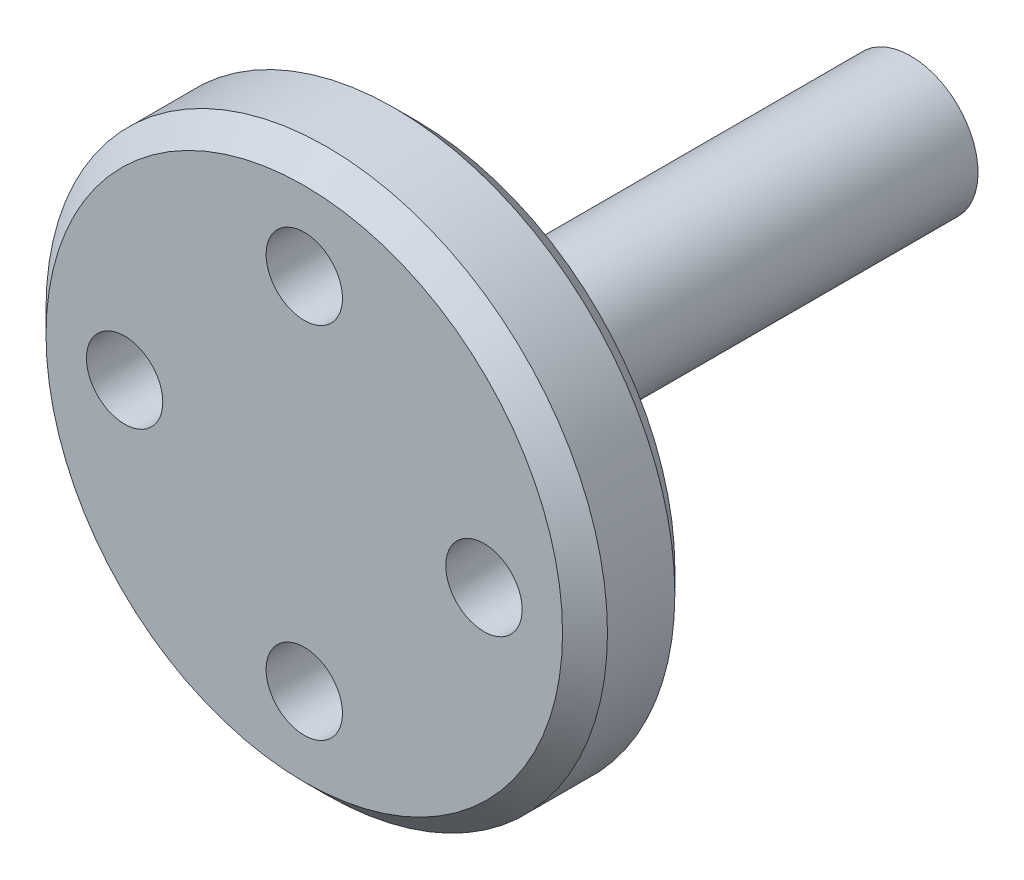
ISO-10303-21;
HEADER;
FILE_DESCRIPTION(('STEP AP214'),'2;1');
FILE_NAME('part.step','',(''),(''),'','','');
FILE_SCHEMA(('AUTOMOTIVE_DESIGN { 1 0 10303 214 1 1 1 1 }'));
ENDSEC;
DATA;
#1=APPLICATION_CONTEXT('core data for automotive mechanical design processes');
#2=APPLICATION_PROTOCOL_DEFINITION('international standard','automotive_design',2000,#1);
#3=PRODUCT_CONTEXT('',#1,'mechanical');
#4=PRODUCT('Part','Part','',(#3));
#5=PRODUCT_RELATED_PRODUCT_CATEGORY('part','',(#4));
#6=PRODUCT_DEFINITION_FORMATION('','',#4);
#7=PRODUCT_DEFINITION_CONTEXT('part definition',#1,'design');
#8=PRODUCT_DEFINITION('design','',#6,#7);
#9=PRODUCT_DEFINITION_SHAPE('','',#8);
#10=(LENGTH_UNIT() NAMED_UNIT(*) SI_UNIT(.MILLI.,.METRE.));
#11=(NAMED_UNIT(*) PLANE_ANGLE_UNIT() SI_UNIT($,.RADIAN.));
#12=(NAMED_UNIT(*) SI_UNIT($,.STERADIAN.) SOLID_ANGLE_UNIT());
#13=UNCERTAINTY_MEASURE_WITH_UNIT(LENGTH_MEASURE(1.E-05),#10,'distance_accuracy_value','');
#14=(GEOMETRIC_REPRESENTATION_CONTEXT(3) GLOBAL_UNCERTAINTY_ASSIGNED_CONTEXT((#13)) GLOBAL_UNIT_ASSIGNED_CONTEXT((#10,
#11,#12)) REPRESENTATION_CONTEXT('',''));
#15=CARTESIAN_POINT('',(0.,0.,0.));
#16=DIRECTION('',(0.,0.,1.));
#17=DIRECTION('',(1.,0.,0.));
#18=AXIS2_PLACEMENT_3D('',#15,#16,#17);
#19=CARTESIAN_POINT('',(0.,12.5,-5.));
#20=DIRECTION('',(0.,0.,-1.));
#21=DIRECTION('',(0.,1.,0.));
#22=AXIS2_PLACEMENT_3D('',#19,#20,#21);
#23=PLANE('',#22);
#24=CARTESIAN_POINT('',(0.,0.,-5.));
#25=DIRECTION('',(0.,0.,-1.));
#26=DIRECTION('',(0.,1.,0.));
#27=AXIS2_PLACEMENT_3D('',#24,#25,#26);
#28=CIRCLE('',#27,11.5);
#29=CARTESIAN_POINT('',(0.,11.5,-5.));
#30=VERTEX_POINT('',#29);
#31=EDGE_CURVE('E65',#30,#30,#28,.T.);
#32=ORIENTED_EDGE('',*,*,#31,.T.);
#33=EDGE_LOOP('',(#32));
#34=FACE_BOUND('',#33,.T.);
#35=CARTESIAN_POINT('',(-8.,0.,-5.));
#36=DIRECTION('',(0.,0.,-1.));
#37=DIRECTION('',(0.,1.,0.));
#38=AXIS2_PLACEMENT_3D('',#35,#36,#37);
#39=CIRCLE('',#38,1.69999999999999);
#40=CARTESIAN_POINT('',(-8.,1.7,-5.));
#41=VERTEX_POINT('',#40);
#42=EDGE_CURVE('E94',#41,#41,#39,.F.);
#43=ORIENTED_EDGE('',*,*,#42,.T.);
#44=EDGE_LOOP('',(#43));
#45=FACE_BOUND('',#44,.T.);
#46=CARTESIAN_POINT('',(8.,0.,-5.));
#47=DIRECTION('',(0.,0.,-1.));
#48=DIRECTION('',(0.,1.,0.));
#49=AXIS2_PLACEMENT_3D('',#46,#47,#48);
#50=CIRCLE('',#49,1.69999999999999);
#51=CARTESIAN_POINT('',(8.,1.7,-5.));
#52=VERTEX_POINT('',#51);
#53=EDGE_CURVE('E79',#52,#52,#50,.F.);
#54=ORIENTED_EDGE('',*,*,#53,.T.);
#55=EDGE_LOOP('',(#54));
#56=FACE_BOUND('',#55,.T.);
#57=CARTESIAN_POINT('',(0.,0.,-5.));
#58=DIRECTION('',(0.,0.,-1.));
#59=DIRECTION('',(0.,1.,0.));
#60=AXIS2_PLACEMENT_3D('',#57,#58,#59);
#61=CIRCLE('',#60,3.00000000000001);
#62=CARTESIAN_POINT('',(0.,3.00000000000001,-5.));
#63=VERTEX_POINT('',#62);
#64=EDGE_CURVE('E71',#63,#63,#61,.T.);
#65=ORIENTED_EDGE('',*,*,#64,.F.);
#66=EDGE_LOOP('',(#65));
#67=FACE_BOUND('',#66,.T.);
#68=CARTESIAN_POINT('',(0.,-8.,-5.00000000000001));
#69=DIRECTION('',(0.,0.,-1.));
#70=DIRECTION('',(0.,1.,0.));
#71=AXIS2_PLACEMENT_3D('',#68,#69,#70);
#72=CIRCLE('',#71,1.69999999999999);
#73=CARTESIAN_POINT('',(0.,-6.3,-5.));
#74=VERTEX_POINT('',#73);
#75=EDGE_CURVE('E86',#74,#74,#72,.F.);
#76=ORIENTED_EDGE('',*,*,#75,.T.);
#77=EDGE_LOOP('',(#76));
#78=FACE_BOUND('',#77,.T.);
#79=CARTESIAN_POINT('',(0.,8.,-5.));
#80=DIRECTION('',(0.,0.,-1.));
#81=DIRECTION('',(0.,1.,0.));
#82=AXIS2_PLACEMENT_3D('',#79,#80,#81);
#83=CIRCLE('',#82,1.69999999999999);
#84=CARTESIAN_POINT('',(0.,9.7,-5.));
#85=VERTEX_POINT('',#84);
#86=EDGE_CURVE('E100',#85,#85,#83,.F.);
#87=ORIENTED_EDGE('',*,*,#86,.T.);
#88=EDGE_LOOP('',(#87));
#89=FACE_BOUND('',#88,.T.);
#90=ADVANCED_FACE('F42',(#34,#45,#56,#67,#78,#89),#23,.T.);
#91=CARTESIAN_POINT('',(0.,0.,0.));
#92=DIRECTION('',(0.,0.,1.));
#93=DIRECTION('',(0.,-1.,0.));
#94=AXIS2_PLACEMENT_3D('',#91,#92,#93);
#95=PLANE('',#94);
#96=CARTESIAN_POINT('',(0.,0.,0.));
#97=DIRECTION('',(0.,0.,1.));
#98=DIRECTION('',(0.,-1.,0.));
#99=AXIS2_PLACEMENT_3D('',#96,#97,#98);
#100=CIRCLE('',#99,11.5);
#101=CARTESIAN_POINT('',(0.,-11.5,0.));
#102=VERTEX_POINT('',#101);
#103=EDGE_CURVE('E10',#102,#102,#100,.T.);
#104=ORIENTED_EDGE('',*,*,#103,.T.);
#105=EDGE_LOOP('',(#104));
#106=FACE_BOUND('',#105,.T.);
#107=CARTESIAN_POINT('',(0.,8.,0.));
#108=DIRECTION('',(0.,0.,1.));
#109=DIRECTION('',(0.,-1.,0.));
#110=AXIS2_PLACEMENT_3D('',#107,#108,#109);
#111=CIRCLE('',#110,1.69999999999999);
#112=CARTESIAN_POINT('',(0.,6.30000000000001,0.));
#113=VERTEX_POINT('',#112);
#114=EDGE_CURVE('E104',#113,#113,#111,.T.);
#115=ORIENTED_EDGE('',*,*,#114,.F.);
#116=EDGE_LOOP('',(#115));
#117=FACE_BOUND('',#116,.T.);
#118=CARTESIAN_POINT('',(-8.,0.,0.));
#119=DIRECTION('',(0.,0.,1.));
#120=DIRECTION('',(0.,-1.,0.));
#121=AXIS2_PLACEMENT_3D('',#118,#119,#120);
#122=CIRCLE('',#121,1.69999999999999);
#123=CARTESIAN_POINT('',(-8.,-1.69999999999999,0.));
#124=VERTEX_POINT('',#123);
#125=EDGE_CURVE('E97',#124,#124,#122,.T.);
#126=ORIENTED_EDGE('',*,*,#125,.F.);
#127=EDGE_LOOP('',(#126));
#128=FACE_BOUND('',#127,.T.);
#129=CARTESIAN_POINT('',(0.,-8.,0.));
#130=DIRECTION('',(0.,0.,1.));
#131=DIRECTION('',(0.,-1.,0.));
#132=AXIS2_PLACEMENT_3D('',#129,#130,#131);
#133=CIRCLE('',#132,1.69999999999999);
#134=CARTESIAN_POINT('',(0.,-9.69999999999999,0.));
#135=VERTEX_POINT('',#134);
#136=EDGE_CURVE('E90',#135,#135,#133,.T.);
#137=ORIENTED_EDGE('',*,*,#136,.F.);
#138=EDGE_LOOP('',(#137));
#139=FACE_BOUND('',#138,.T.);
#140=CARTESIAN_POINT('',(8.,0.,0.));
#141=DIRECTION('',(0.,0.,1.));
#142=DIRECTION('',(0.,-1.,0.));
#143=AXIS2_PLACEMENT_3D('',#140,#141,#142);
#144=CIRCLE('',#143,1.69999999999999);
#145=CARTESIAN_POINT('',(8.,-1.69999999999999,0.));
#146=VERTEX_POINT('',#145);
#147=EDGE_CURVE('E82',#146,#146,#144,.T.);
#148=ORIENTED_EDGE('',*,*,#147,.F.);
#149=EDGE_LOOP('',(#148));
#150=FACE_BOUND('',#149,.T.);
#151=ADVANCED_FACE('F110',(#106,#117,#128,#139,#150),#95,.T.);
#152=CARTESIAN_POINT('',(0.,0.,-27.));
#153=DIRECTION('',(0.,0.,-1.));
#154=DIRECTION('',(0.,1.,0.));
#155=AXIS2_PLACEMENT_3D('',#152,#153,#154);
#156=CYLINDRICAL_SURFACE('',#155,12.5);
#157=CARTESIAN_POINT('',(0.,0.,-4.));
#158=DIRECTION('',(0.,0.,-1.));
#159=DIRECTION('',(0.,1.,0.));
#160=AXIS2_PLACEMENT_3D('',#157,#158,#159);
#161=CIRCLE('',#160,12.5);
#162=CARTESIAN_POINT('',(0.,12.5,-4.));
#163=VERTEX_POINT('',#162);
#164=EDGE_CURVE('E51',#163,#163,#161,.F.);
#165=ORIENTED_EDGE('',*,*,#164,.T.);
#166=EDGE_LOOP('',(#165));
#167=FACE_BOUND('',#166,.T.);
#168=CARTESIAN_POINT('',(0.,0.,-0.999999999999997));
#169=DIRECTION('',(0.,0.,1.));
#170=DIRECTION('',(0.,-1.,0.));
#171=AXIS2_PLACEMENT_3D('',#168,#169,#170);
#172=CIRCLE('',#171,12.5);
#173=CARTESIAN_POINT('',(0.,-12.5,-1.));
#174=VERTEX_POINT('',#173);
#175=EDGE_CURVE('E58',#174,#174,#172,.F.);
#176=ORIENTED_EDGE('',*,*,#175,.T.);
#177=EDGE_LOOP('',(#176));
#178=FACE_BOUND('',#177,.T.);
#179=ADVANCED_FACE('F113',(#167,#178),#156,.T.);
#180=CARTESIAN_POINT('',(0.,0.,-27.));
#181=DIRECTION('',(0.,0.,-1.));
#182=DIRECTION('',(0.,1.,0.));
#183=AXIS2_PLACEMENT_3D('',#180,#181,#182);
#184=CYLINDRICAL_SURFACE('',#183,3.);
#185=ORIENTED_EDGE('',*,*,#64,.T.);
#186=EDGE_LOOP('',(#185));
#187=FACE_BOUND('',#186,.T.);
#188=CARTESIAN_POINT('',(0.,0.,-27.));
#189=DIRECTION('',(0.,0.,-1.));
#190=DIRECTION('',(0.,1.,0.));
#191=AXIS2_PLACEMENT_3D('',#188,#189,#190);
#192=CIRCLE('',#191,3.);
#193=CARTESIAN_POINT('',(0.,3.00000000000001,-27.));
#194=VERTEX_POINT('',#193);
#195=EDGE_CURVE('E75',#194,#194,#192,.T.);
#196=ORIENTED_EDGE('',*,*,#195,.F.);
#197=EDGE_LOOP('',(#196));
#198=FACE_BOUND('',#197,.T.);
#199=ADVANCED_FACE('F134',(#187,#198),#184,.T.);
#200=CARTESIAN_POINT('',(0.,3.00000000000001,-27.));
#201=DIRECTION('',(0.,0.,-1.));
#202=DIRECTION('',(0.,1.,0.));
#203=AXIS2_PLACEMENT_3D('',#200,#201,#202);
#204=PLANE('',#203);
#205=ORIENTED_EDGE('',*,*,#195,.T.);
#206=EDGE_LOOP('',(#205));
#207=FACE_BOUND('',#206,.T.);
#208=ADVANCED_FACE('F124',(#207),#204,.T.);
#209=CARTESIAN_POINT('',(8.,0.,0.));
#210=DIRECTION('',(0.,0.,1.));
#211=DIRECTION('',(0.,-1.,0.));
#212=AXIS2_PLACEMENT_3D('',#209,#210,#211);
#213=CYLINDRICAL_SURFACE('',#212,1.69999999999999);
#214=ORIENTED_EDGE('',*,*,#53,.F.);
#215=EDGE_LOOP('',(#214));
#216=FACE_BOUND('',#215,.T.);
#217=ORIENTED_EDGE('',*,*,#147,.T.);
#218=EDGE_LOOP('',(#217));
#219=FACE_BOUND('',#218,.T.);
#220=ADVANCED_FACE('F121',(#216,#219),#213,.F.);
#221=CARTESIAN_POINT('',(0.,-8.,0.));
#222=DIRECTION('',(0.,0.,1.));
#223=DIRECTION('',(0.,-1.,0.));
#224=AXIS2_PLACEMENT_3D('',#221,#222,#223);
#225=CYLINDRICAL_SURFACE('',#224,1.69999999999999);
#226=ORIENTED_EDGE('',*,*,#75,.F.);
#227=EDGE_LOOP('',(#226));
#228=FACE_BOUND('',#227,.T.);
#229=ORIENTED_EDGE('',*,*,#136,.T.);
#230=EDGE_LOOP('',(#229));
#231=FACE_BOUND('',#230,.T.);
#232=ADVANCED_FACE('F123',(#228,#231),#225,.F.);
#233=CARTESIAN_POINT('',(-8.,0.,0.));
#234=DIRECTION('',(0.,0.,1.));
#235=DIRECTION('',(0.,-1.,0.));
#236=AXIS2_PLACEMENT_3D('',#233,#234,#235);
#237=CYLINDRICAL_SURFACE('',#236,1.69999999999999);
#238=ORIENTED_EDGE('',*,*,#42,.F.);
#239=EDGE_LOOP('',(#238));
#240=FACE_BOUND('',#239,.T.);
#241=ORIENTED_EDGE('',*,*,#125,.T.);
#242=EDGE_LOOP('',(#241));
#243=FACE_BOUND('',#242,.T.);
#244=ADVANCED_FACE('F131',(#240,#243),#237,.F.);
#245=CARTESIAN_POINT('',(0.,8.,0.));
#246=DIRECTION('',(0.,0.,1.));
#247=DIRECTION('',(0.,-1.,0.));
#248=AXIS2_PLACEMENT_3D('',#245,#246,#247);
#249=CYLINDRICAL_SURFACE('',#248,1.69999999999999);
#250=ORIENTED_EDGE('',*,*,#86,.F.);
#251=EDGE_LOOP('',(#250));
#252=FACE_BOUND('',#251,.T.);
#253=ORIENTED_EDGE('',*,*,#114,.T.);
#254=EDGE_LOOP('',(#253));
#255=FACE_BOUND('',#254,.T.);
#256=ADVANCED_FACE('F108',(#252,#255),#249,.F.);
#257=CARTESIAN_POINT('',(0.,0.,-5.));
#258=DIRECTION('',(0.,0.,1.));
#259=DIRECTION('',(0.,-1.,0.));
#260=AXIS2_PLACEMENT_3D('',#257,#258,#259);
#261=CONICAL_SURFACE('',#260,11.5,0.785398163397447);
#262=ORIENTED_EDGE('',*,*,#164,.F.);
#263=EDGE_LOOP('',(#262));
#264=FACE_BOUND('',#263,.T.);
#265=ORIENTED_EDGE('',*,*,#31,.F.);
#266=EDGE_LOOP('',(#265));
#267=FACE_BOUND('',#266,.T.);
#268=ADVANCED_FACE('F148',(#264,#267),#261,.T.);
#269=CARTESIAN_POINT('',(0.,0.,-0.999999999999997));
#270=DIRECTION('',(0.,0.,-1.));
#271=DIRECTION('',(0.,1.,0.));
#272=AXIS2_PLACEMENT_3D('',#269,#270,#271);
#273=CONICAL_SURFACE('',#272,12.5,0.785398163397454);
#274=ORIENTED_EDGE('',*,*,#103,.F.);
#275=EDGE_LOOP('',(#274));
#276=FACE_BOUND('',#275,.T.);
#277=ORIENTED_EDGE('',*,*,#175,.F.);
#278=EDGE_LOOP('',(#277));
#279=FACE_BOUND('',#278,.T.);
#280=ADVANCED_FACE('F45',(#276,#279),#273,.T.);
#281=CLOSED_SHELL('',(#90,#151,#179,#199,#208,#220,#232,#244,#256,#268,#280));
#282=MANIFOLD_SOLID_BREP('B2',#281);
#283=ADVANCED_BREP_SHAPE_REPRESENTATION('',(#18,#282),#14);
#284=SHAPE_DEFINITION_REPRESENTATION(#9,#283);
ENDSEC;
END-ISO-10303-21;
